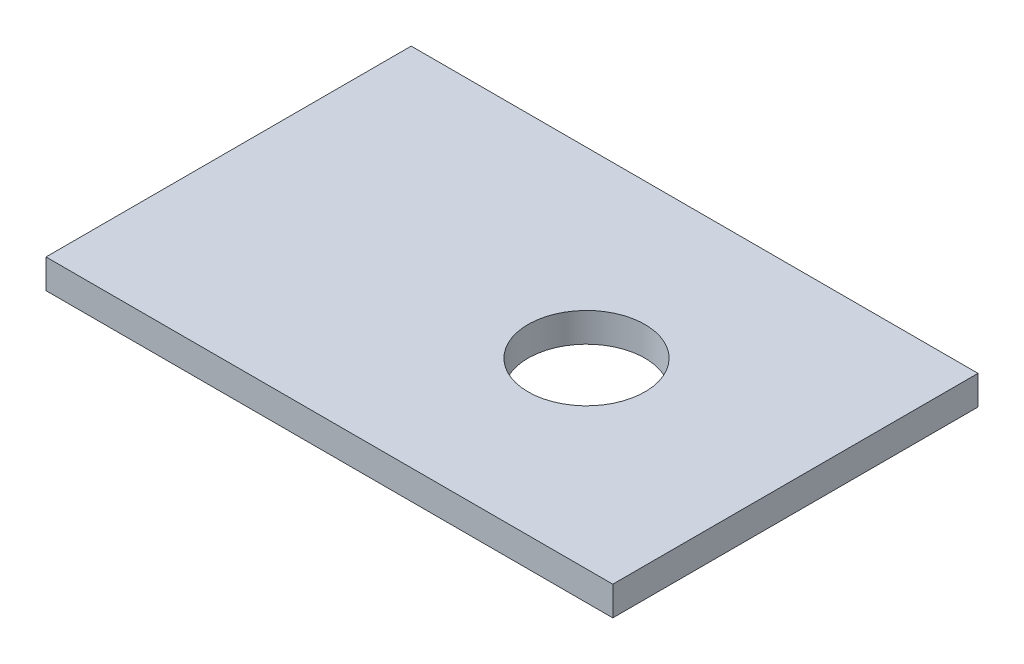
ISO-10303-21;
HEADER;
FILE_DESCRIPTION(('STEP AP214'),'2;1');
FILE_NAME('part.step','',(''),(''),'','','');
FILE_SCHEMA(('AUTOMOTIVE_DESIGN { 1 0 10303 214 1 1 1 1 }'));
ENDSEC;
DATA;
#1=APPLICATION_CONTEXT('core data for automotive mechanical design processes');
#2=APPLICATION_PROTOCOL_DEFINITION('international standard','automotive_design',2000,#1);
#3=PRODUCT_CONTEXT('',#1,'mechanical');
#4=PRODUCT('Part','Part','',(#3));
#5=PRODUCT_RELATED_PRODUCT_CATEGORY('part','',(#4));
#6=PRODUCT_DEFINITION_FORMATION('','',#4);
#7=PRODUCT_DEFINITION_CONTEXT('part definition',#1,'design');
#8=PRODUCT_DEFINITION('design','',#6,#7);
#9=PRODUCT_DEFINITION_SHAPE('','',#8);
#10=(LENGTH_UNIT() NAMED_UNIT(*) SI_UNIT(.MILLI.,.METRE.));
#11=(NAMED_UNIT(*) PLANE_ANGLE_UNIT() SI_UNIT($,.RADIAN.));
#12=(NAMED_UNIT(*) SI_UNIT($,.STERADIAN.) SOLID_ANGLE_UNIT());
#13=UNCERTAINTY_MEASURE_WITH_UNIT(LENGTH_MEASURE(1.E-05),#10,'distance_accuracy_value','');
#14=(GEOMETRIC_REPRESENTATION_CONTEXT(3) GLOBAL_UNCERTAINTY_ASSIGNED_CONTEXT((#13)) GLOBAL_UNIT_ASSIGNED_CONTEXT((#10,
#11,#12)) REPRESENTATION_CONTEXT('',''));
#15=CARTESIAN_POINT('',(0.,0.,0.));
#16=DIRECTION('',(0.,0.,1.));
#17=DIRECTION('',(1.,0.,0.));
#18=AXIS2_PLACEMENT_3D('',#15,#16,#17);
#19=CARTESIAN_POINT('',(19.4,2.,12.5));
#20=DIRECTION('',(-1.,0.,0.));
#21=DIRECTION('',(0.,0.,1.));
#22=AXIS2_PLACEMENT_3D('',#19,#20,#21);
#23=PLANE('',#22);
#24=DIRECTION('',(0.,0.,-1.));
#25=VECTOR('',#24,1.);
#26=CARTESIAN_POINT('',(19.4,0.,12.5));
#27=LINE('',#26,#25);
#28=CARTESIAN_POINT('',(19.4,0.,12.5));
#29=VERTEX_POINT('',#28);
#30=CARTESIAN_POINT('',(19.4,0.,-12.5));
#31=VERTEX_POINT('',#30);
#32=EDGE_CURVE('E107',#29,#31,#27,.T.);
#33=ORIENTED_EDGE('',*,*,#32,.T.);
#34=DIRECTION('',(0.,-1.,0.));
#35=VECTOR('',#34,1.);
#36=CARTESIAN_POINT('',(19.4,2.,-12.5));
#37=LINE('',#36,#35);
#38=CARTESIAN_POINT('',(19.4,2.,-12.5));
#39=VERTEX_POINT('',#38);
#40=EDGE_CURVE('E11',#39,#31,#37,.T.);
#41=ORIENTED_EDGE('',*,*,#40,.F.);
#42=DIRECTION('',(0.,0.,-1.));
#43=VECTOR('',#42,1.);
#44=CARTESIAN_POINT('',(19.4,2.,12.5));
#45=LINE('',#44,#43);
#46=CARTESIAN_POINT('',(19.4,2.,12.5));
#47=VERTEX_POINT('',#46);
#48=EDGE_CURVE('E91',#47,#39,#45,.T.);
#49=ORIENTED_EDGE('',*,*,#48,.F.);
#50=DIRECTION('',(0.,-1.,0.));
#51=VECTOR('',#50,1.);
#52=CARTESIAN_POINT('',(19.4,2.,12.5));
#53=LINE('',#52,#51);
#54=EDGE_CURVE('E103',#47,#29,#53,.T.);
#55=ORIENTED_EDGE('',*,*,#54,.T.);
#56=EDGE_LOOP('',(#33,#41,#49,#55));
#57=FACE_BOUND('',#56,.T.);
#58=ADVANCED_FACE('F39',(#57),#23,.F.);
#59=CARTESIAN_POINT('',(-19.4,2.,-12.5));
#60=DIRECTION('',(0.,0.,1.));
#61=DIRECTION('',(1.,0.,0.));
#62=AXIS2_PLACEMENT_3D('',#59,#60,#61);
#63=PLANE('',#62);
#64=DIRECTION('',(-1.,0.,0.));
#65=VECTOR('',#64,1.);
#66=CARTESIAN_POINT('',(-19.4,0.,-12.5));
#67=LINE('',#66,#65);
#68=CARTESIAN_POINT('',(-19.4,0.,-12.5));
#69=VERTEX_POINT('',#68);
#70=EDGE_CURVE('E96',#31,#69,#67,.T.);
#71=ORIENTED_EDGE('',*,*,#70,.T.);
#72=DIRECTION('',(0.,-1.,0.));
#73=VECTOR('',#72,1.);
#74=CARTESIAN_POINT('',(-19.4,2.,-12.5));
#75=LINE('',#74,#73);
#76=CARTESIAN_POINT('',(-19.4,2.,-12.5));
#77=VERTEX_POINT('',#76);
#78=EDGE_CURVE('E48',#77,#69,#75,.T.);
#79=ORIENTED_EDGE('',*,*,#78,.F.);
#80=DIRECTION('',(-1.,0.,0.));
#81=VECTOR('',#80,1.);
#82=CARTESIAN_POINT('',(-19.4,2.,-12.5));
#83=LINE('',#82,#81);
#84=EDGE_CURVE('E86',#39,#77,#83,.T.);
#85=ORIENTED_EDGE('',*,*,#84,.F.);
#86=ORIENTED_EDGE('',*,*,#40,.T.);
#87=EDGE_LOOP('',(#71,#79,#85,#86));
#88=FACE_BOUND('',#87,.T.);
#89=ADVANCED_FACE('F95',(#88),#63,.F.);
#90=CARTESIAN_POINT('',(-19.4,2.,12.5));
#91=DIRECTION('',(1.,0.,0.));
#92=DIRECTION('',(0.,0.,-1.));
#93=AXIS2_PLACEMENT_3D('',#90,#91,#92);
#94=PLANE('',#93);
#95=DIRECTION('',(0.,0.,1.));
#96=VECTOR('',#95,1.);
#97=CARTESIAN_POINT('',(-19.4,0.,12.5));
#98=LINE('',#97,#96);
#99=CARTESIAN_POINT('',(-19.4,0.,12.5));
#100=VERTEX_POINT('',#99);
#101=EDGE_CURVE('E73',#69,#100,#98,.T.);
#102=ORIENTED_EDGE('',*,*,#101,.T.);
#103=DIRECTION('',(0.,-1.,0.));
#104=VECTOR('',#103,1.);
#105=CARTESIAN_POINT('',(-19.4,2.,12.5));
#106=LINE('',#105,#104);
#107=CARTESIAN_POINT('',(-19.4,2.,12.5));
#108=VERTEX_POINT('',#107);
#109=EDGE_CURVE('E98',#108,#100,#106,.T.);
#110=ORIENTED_EDGE('',*,*,#109,.F.);
#111=DIRECTION('',(0.,0.,1.));
#112=VECTOR('',#111,1.);
#113=CARTESIAN_POINT('',(-19.4,2.,12.5));
#114=LINE('',#113,#112);
#115=EDGE_CURVE('E89',#77,#108,#114,.T.);
#116=ORIENTED_EDGE('',*,*,#115,.F.);
#117=ORIENTED_EDGE('',*,*,#78,.T.);
#118=EDGE_LOOP('',(#102,#110,#116,#117));
#119=FACE_BOUND('',#118,.T.);
#120=ADVANCED_FACE('F99',(#119),#94,.F.);
#121=CARTESIAN_POINT('',(-19.4,2.,12.5));
#122=DIRECTION('',(0.,0.,-1.));
#123=DIRECTION('',(-1.,0.,0.));
#124=AXIS2_PLACEMENT_3D('',#121,#122,#123);
#125=PLANE('',#124);
#126=DIRECTION('',(1.,0.,0.));
#127=VECTOR('',#126,1.);
#128=CARTESIAN_POINT('',(-19.4,0.,12.5));
#129=LINE('',#128,#127);
#130=EDGE_CURVE('E79',#100,#29,#129,.T.);
#131=ORIENTED_EDGE('',*,*,#130,.T.);
#132=ORIENTED_EDGE('',*,*,#54,.F.);
#133=DIRECTION('',(1.,0.,0.));
#134=VECTOR('',#133,1.);
#135=CARTESIAN_POINT('',(-19.4,2.,12.5));
#136=LINE('',#135,#134);
#137=EDGE_CURVE('E56',#108,#47,#136,.T.);
#138=ORIENTED_EDGE('',*,*,#137,.F.);
#139=ORIENTED_EDGE('',*,*,#109,.T.);
#140=EDGE_LOOP('',(#131,#132,#138,#139));
#141=FACE_BOUND('',#140,.T.);
#142=ADVANCED_FACE('F121',(#141),#125,.F.);
#143=CARTESIAN_POINT('',(0.,2.,0.));
#144=DIRECTION('',(0.,-1.,0.));
#145=DIRECTION('',(0.,0.,-1.));
#146=AXIS2_PLACEMENT_3D('',#143,#144,#145);
#147=PLANE('',#146);
#148=CARTESIAN_POINT('',(5.10000000000001,2.,0.));
#149=DIRECTION('',(0.,1.,0.));
#150=DIRECTION('',(0.,0.,1.));
#151=AXIS2_PLACEMENT_3D('',#148,#149,#150);
#152=CIRCLE('',#151,4.);
#153=CARTESIAN_POINT('',(5.10000000000001,2.,4.));
#154=VERTEX_POINT('',#153);
#155=EDGE_CURVE('E128',#154,#154,#152,.T.);
#156=ORIENTED_EDGE('',*,*,#155,.F.);
#157=EDGE_LOOP('',(#156));
#158=FACE_BOUND('',#157,.T.);
#159=ORIENTED_EDGE('',*,*,#48,.T.);
#160=ORIENTED_EDGE('',*,*,#84,.T.);
#161=ORIENTED_EDGE('',*,*,#115,.T.);
#162=ORIENTED_EDGE('',*,*,#137,.T.);
#163=EDGE_LOOP('',(#159,#160,#161,#162));
#164=FACE_BOUND('',#163,.T.);
#165=ADVANCED_FACE('F87',(#158,#164),#147,.F.);
#166=CARTESIAN_POINT('',(0.,0.,0.));
#167=DIRECTION('',(0.,-1.,0.));
#168=DIRECTION('',(0.,0.,-1.));
#169=AXIS2_PLACEMENT_3D('',#166,#167,#168);
#170=PLANE('',#169);
#171=CARTESIAN_POINT('',(5.10000000000001,0.,0.));
#172=DIRECTION('',(0.,1.,0.));
#173=DIRECTION('',(0.,0.,1.));
#174=AXIS2_PLACEMENT_3D('',#171,#172,#173);
#175=CIRCLE('',#174,4.);
#176=CARTESIAN_POINT('',(5.10000000000001,0.,4.));
#177=VERTEX_POINT('',#176);
#178=EDGE_CURVE('E111',#177,#177,#175,.T.);
#179=ORIENTED_EDGE('',*,*,#178,.T.);
#180=EDGE_LOOP('',(#179));
#181=FACE_BOUND('',#180,.T.);
#182=ORIENTED_EDGE('',*,*,#32,.F.);
#183=ORIENTED_EDGE('',*,*,#130,.F.);
#184=ORIENTED_EDGE('',*,*,#101,.F.);
#185=ORIENTED_EDGE('',*,*,#70,.F.);
#186=EDGE_LOOP('',(#182,#183,#184,#185));
#187=FACE_BOUND('',#186,.T.);
#188=ADVANCED_FACE('F124',(#181,#187),#170,.T.);
#189=CARTESIAN_POINT('',(5.10000000000001,0.,0.));
#190=DIRECTION('',(0.,1.,0.));
#191=DIRECTION('',(0.,0.,1.));
#192=AXIS2_PLACEMENT_3D('',#189,#190,#191);
#193=CYLINDRICAL_SURFACE('',#192,4.);
#194=ORIENTED_EDGE('',*,*,#178,.F.);
#195=EDGE_LOOP('',(#194));
#196=FACE_BOUND('',#195,.T.);
#197=ORIENTED_EDGE('',*,*,#155,.T.);
#198=EDGE_LOOP('',(#197));
#199=FACE_BOUND('',#198,.T.);
#200=ADVANCED_FACE('F137',(#196,#199),#193,.F.);
#201=CLOSED_SHELL('',(#58,#89,#120,#142,#165,#188,#200));
#202=MANIFOLD_SOLID_BREP('B2',#201);
#203=ADVANCED_BREP_SHAPE_REPRESENTATION('',(#18,#202),#14);
#204=SHAPE_DEFINITION_REPRESENTATION(#9,#203);
ENDSEC;
END-ISO-10303-21;
